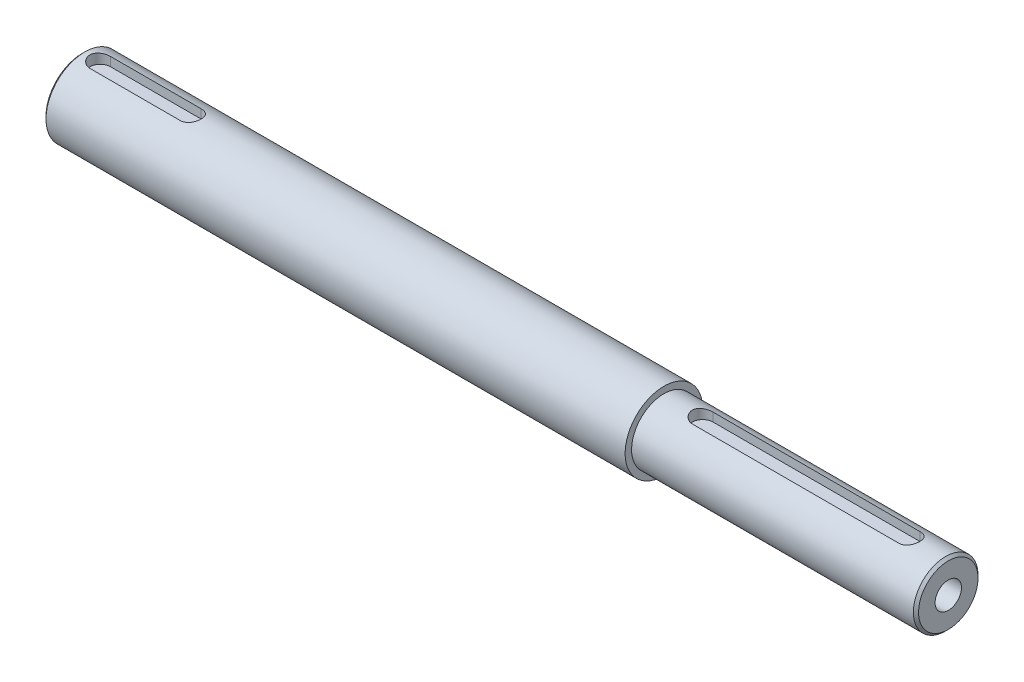
ISO-10303-21;
HEADER;
FILE_DESCRIPTION(('STEP AP214'),'2;1');
FILE_NAME('part.step','',(''),(''),'','','');
FILE_SCHEMA(('AUTOMOTIVE_DESIGN { 1 0 10303 214 1 1 1 1 }'));
ENDSEC;
DATA;
#1=APPLICATION_CONTEXT('core data for automotive mechanical design processes');
#2=APPLICATION_PROTOCOL_DEFINITION('international standard','automotive_design',2000,#1);
#3=PRODUCT_CONTEXT('',#1,'mechanical');
#4=PRODUCT('Part','Part','',(#3));
#5=PRODUCT_RELATED_PRODUCT_CATEGORY('part','',(#4));
#6=PRODUCT_DEFINITION_FORMATION('','',#4);
#7=PRODUCT_DEFINITION_CONTEXT('part definition',#1,'design');
#8=PRODUCT_DEFINITION('design','',#6,#7);
#9=PRODUCT_DEFINITION_SHAPE('','',#8);
#10=(LENGTH_UNIT() NAMED_UNIT(*) SI_UNIT(.MILLI.,.METRE.));
#11=(NAMED_UNIT(*) PLANE_ANGLE_UNIT() SI_UNIT($,.RADIAN.));
#12=(NAMED_UNIT(*) SI_UNIT($,.STERADIAN.) SOLID_ANGLE_UNIT());
#13=UNCERTAINTY_MEASURE_WITH_UNIT(LENGTH_MEASURE(1.E-05),#10,'distance_accuracy_value','');
#14=(GEOMETRIC_REPRESENTATION_CONTEXT(3) GLOBAL_UNCERTAINTY_ASSIGNED_CONTEXT((#13)) GLOBAL_UNIT_ASSIGNED_CONTEXT((#10,
#11,#12)) REPRESENTATION_CONTEXT('',''));
#15=CARTESIAN_POINT('',(0.,0.,0.));
#16=DIRECTION('',(0.,0.,1.));
#17=DIRECTION('',(1.,0.,0.));
#18=AXIS2_PLACEMENT_3D('',#15,#16,#17);
#19=CARTESIAN_POINT('',(74.7271192989297,0.,0.));
#20=DIRECTION('',(-1.,0.,0.));
#21=DIRECTION('',(0.,-1.,0.));
#22=AXIS2_PLACEMENT_3D('',#19,#20,#21);
#23=CYLINDRICAL_SURFACE('',#22,14.9999999999998);
#24=CARTESIAN_POINT('',(-166.5,2.64961082682653E-13,0.));
#25=DIRECTION('',(1.,0.,0.));
#26=DIRECTION('',(0.,1.,0.));
#27=AXIS2_PLACEMENT_3D('',#24,#25,#26);
#28=CIRCLE('',#27,14.9999999999998);
#29=CARTESIAN_POINT('',(-166.5,15.0000000000001,0.));
#30=VERTEX_POINT('',#29);
#31=EDGE_CURVE('E11',#30,#30,#28,.T.);
#32=ORIENTED_EDGE('',*,*,#31,.T.);
#33=EDGE_LOOP('',(#32));
#34=FACE_BOUND('',#33,.T.);
#35=CARTESIAN_POINT('',(57.5,0.,0.));
#36=DIRECTION('',(-1.,0.,0.));
#37=DIRECTION('',(0.,-1.,0.));
#38=AXIS2_PLACEMENT_3D('',#35,#36,#37);
#39=CIRCLE('',#38,15.);
#40=CARTESIAN_POINT('',(57.5,-14.9999999999999,0.));
#41=VERTEX_POINT('',#40);
#42=EDGE_CURVE('E157',#41,#41,#39,.T.);
#43=ORIENTED_EDGE('',*,*,#42,.T.);
#44=EDGE_LOOP('',(#43));
#45=FACE_BOUND('',#44,.T.);
#46=CARTESIAN_POINT('',(-125.5,14.456832294801,4.));
#47=CARTESIAN_POINT('',(-125.389641756596,14.4568189842468,4.00001309389174));
#48=CARTESIAN_POINT('',(-125.279291478007,14.4580956467717,3.99543311151603));
#49=CARTESIAN_POINT('',(-125.059421346034,14.4631301353517,3.97718874589725));
#50=CARTESIAN_POINT('',(-124.94990134224,14.466887500596,3.96352604983924));
#51=CARTESIAN_POINT('',(-124.732698346486,14.4767740441059,3.92725695741262));
#52=CARTESIAN_POINT('',(-124.625011912152,14.482898107258,3.90466984692445));
#53=CARTESIAN_POINT('',(-124.412025139644,14.4973231400468,3.85076543838184));
#54=CARTESIAN_POINT('',(-124.306724843415,14.5056241479175,3.81944798699437));
#55=CARTESIAN_POINT('',(-123.995536581225,14.5334412456827,3.71275643853686));
#56=CARTESIAN_POINT('',(-123.794125066453,14.5558829598252,3.62460332607935));
#57=CARTESIAN_POINT('',(-123.408979240374,14.6060171290377,3.41695780475819));
#58=CARTESIAN_POINT('',(-123.225250796028,14.6337113178035,3.29745504324306));
#59=CARTESIAN_POINT('',(-122.876029423072,14.6920016406367,3.0273032087801));
#60=CARTESIAN_POINT('',(-122.711038159034,14.7226489452443,2.87601544465619));
#61=CARTESIAN_POINT('',(-122.408442433038,14.7829523618629,2.54795832924029));
#62=CARTESIAN_POINT('',(-122.270842417132,14.8126083123118,2.37118484921248));
#63=CARTESIAN_POINT('',(-122.024827869815,14.8681604116922,1.99367199592155));
#64=CARTESIAN_POINT('',(-121.916916034422,14.8939887414058,1.79259414843396));
#65=CARTESIAN_POINT('',(-121.736627111039,14.9383834129136,1.3743557555279));
#66=CARTESIAN_POINT('',(-121.664242355223,14.9569513215518,1.15719869214847));
#67=CARTESIAN_POINT('',(-121.558690174831,14.9843709217853,0.718234307369671));
#68=CARTESIAN_POINT('',(-121.524662787106,14.9934353394138,0.496647293428105));
#69=CARTESIAN_POINT('',(-121.494085686777,15.0015705103633,0.050731991760575));
#70=CARTESIAN_POINT('',(-121.497530515807,15.0006427191927,-0.173595891963459));
#71=CARTESIAN_POINT('',(-121.541195686368,14.9890534931377,-0.612629502642175));
#72=CARTESIAN_POINT('',(-121.580486127656,14.9786381919443,-0.827435206418328));
#73=CARTESIAN_POINT('',(-121.693225150863,14.9495347795913,-1.24728467665105));
#74=CARTESIAN_POINT('',(-121.766675352151,14.9308462762364,-1.45232797980576));
#75=CARTESIAN_POINT('',(-121.946359966253,14.8869312076945,-1.84920963545356));
#76=CARTESIAN_POINT('',(-122.05291337223,14.8616414267933,-2.04089626466617));
#77=CARTESIAN_POINT('',(-122.295542768965,14.8072486052897,-2.40398441957148));
#78=CARTESIAN_POINT('',(-122.431623922183,14.7781448982354,-2.57538239000351));
#79=CARTESIAN_POINT('',(-122.734327971101,14.7182294237973,-2.89854935036781));
#80=CARTESIAN_POINT('',(-122.901758007894,14.6873926412644,-3.04955722400808));
#81=CARTESIAN_POINT('',(-123.260042840709,14.6282716207252,-3.32161448391783));
#82=CARTESIAN_POINT('',(-123.450904096481,14.599988090371,-3.4426555807802));
#83=CARTESIAN_POINT('',(-123.751353283365,14.5618587427771,-3.59932937334134));
#84=CARTESIAN_POINT('',(-123.854288915041,14.5498268172621,-3.64754371945348));
#85=CARTESIAN_POINT('',(-124.064046321272,14.5275984074126,-3.73509417643327));
#86=CARTESIAN_POINT('',(-124.170866512463,14.5174011851058,-3.77443385857864));
#87=CARTESIAN_POINT('',(-124.38751941922,14.4991713081512,-3.84386783810501));
#88=CARTESIAN_POINT('',(-124.497348878193,14.4911364080612,-3.87397173088604));
#89=CARTESIAN_POINT('',(-124.719275221125,14.4774747012192,-3.92471856960775));
#90=CARTESIAN_POINT('',(-124.83137102282,14.4718467722231,-3.9453659249532));
#91=CARTESIAN_POINT('',(-125.036251024718,14.463976133431,-3.97411378733403));
#92=CARTESIAN_POINT('',(-125.128796446167,14.4613012625134,-3.98382319960777));
#93=CARTESIAN_POINT('',(-125.31422535331,14.4577275048597,-3.99676420153356));
#94=CARTESIAN_POINT('',(-125.407108070432,14.456825809226,-4.00000603663184));
#95=CARTESIAN_POINT('',(-125.5,14.456832294801,-4.));
#96=B_SPLINE_CURVE_WITH_KNOTS('',3,(#46,#47,#48,#49,#50,#51,#52,#53,#54,#55,#56,#57,#58,#59,#60,
#61,#62,#63,#64,#65,#66,#67,#68,#69,#70,#71,#72,#73,#74,#75,#76,#77,#78,#79,#80,#81,#82,#83,#84,
#85,#86,#87,#88,#89,#90,#91,#92,#93,#94,#95),.UNSPECIFIED.,.F.,.F.,(4,2,2,2,2,2,2,2,2,2,2,2,2,2,
2,2,2,2,2,2,2,2,2,2,4),(0.,0.330958670878051,0.661855880768524,0.992041890688609,
1.32223370010826,1.98190700187183,2.64179842357631,3.3164963753615,3.99130375261119,
4.67691814590523,5.36238449759351,6.03215661862343,6.7018311790669,7.35461236515046,
8.00742449996359,8.66673340793704,9.32615767867957,10.0057598785669,10.6855498604333,
11.0281077435251,11.3705275300852,11.7125903499582,12.0544935096115,12.3335333037377,
12.6121307120356),.UNSPECIFIED.);
#97=CARTESIAN_POINT('',(-125.5,14.456832294801,4.));
#98=VERTEX_POINT('',#97);
#99=CARTESIAN_POINT('',(-125.5,14.456832294801,-4.));
#100=VERTEX_POINT('',#99);
#101=EDGE_CURVE('E202',#98,#100,#96,.T.);
#102=ORIENTED_EDGE('',*,*,#101,.F.);
#103=DIRECTION('',(-1.,0.,0.));
#104=VECTOR('',#103,1.);
#105=CARTESIAN_POINT('',(74.7271192989297,14.4568322948008,4.));
#106=LINE('',#105,#104);
#107=CARTESIAN_POINT('',(-160.5,14.456832294801,4.));
#108=VERTEX_POINT('',#107);
#109=EDGE_CURVE('E250',#108,#98,#106,.F.);
#110=ORIENTED_EDGE('',*,*,#109,.F.);
#111=CARTESIAN_POINT('',(-160.5,14.4568322948011,-4.));
#112=CARTESIAN_POINT('',(-160.610358243404,14.4568189842468,-4.00001309389174));
#113=CARTESIAN_POINT('',(-160.720708521993,14.4580956467718,-3.99543311151603));
#114=CARTESIAN_POINT('',(-160.940578653966,14.4631301353518,-3.97718874589725));
#115=CARTESIAN_POINT('',(-161.05009865776,14.466887500596,-3.96352604983924));
#116=CARTESIAN_POINT('',(-161.267301653514,14.4767740441059,-3.92725695741263));
#117=CARTESIAN_POINT('',(-161.374988087848,14.4828981072581,-3.90466984692446));
#118=CARTESIAN_POINT('',(-161.587974860356,14.4973231400468,-3.85076543838184));
#119=CARTESIAN_POINT('',(-161.693275156585,14.5056241479175,-3.81944798699437));
#120=CARTESIAN_POINT('',(-162.004463418775,14.5334412456828,-3.71275643853686));
#121=CARTESIAN_POINT('',(-162.205874933547,14.5558829598253,-3.62460332607936));
#122=CARTESIAN_POINT('',(-162.591020759626,14.6060171290378,-3.4169578047582));
#123=CARTESIAN_POINT('',(-162.774749203972,14.6337113178036,-3.29745504324306));
#124=CARTESIAN_POINT('',(-163.123970576928,14.6920016406367,-3.02730320878009));
#125=CARTESIAN_POINT('',(-163.288961840966,14.7226489452443,-2.87601544465618));
#126=CARTESIAN_POINT('',(-163.591557566962,14.7829523618629,-2.54795832924028));
#127=CARTESIAN_POINT('',(-163.729157582868,14.8126083123118,-2.37118484921248));
#128=CARTESIAN_POINT('',(-163.975172130186,14.8681604116922,-1.99367199592156));
#129=CARTESIAN_POINT('',(-164.083083965578,14.8939887414058,-1.79259414843396));
#130=CARTESIAN_POINT('',(-164.263372888961,14.9383834129137,-1.3743557555279));
#131=CARTESIAN_POINT('',(-164.335757644777,14.9569513215519,-1.15719869214845));
#132=CARTESIAN_POINT('',(-164.441309825169,14.9843709217853,-0.718234307369657));
#133=CARTESIAN_POINT('',(-164.475337212894,14.9934353394138,-0.496647293428093));
#134=CARTESIAN_POINT('',(-164.505914313223,15.0015705103633,-0.0507319917605658));
#135=CARTESIAN_POINT('',(-164.502469484193,15.0006427191927,0.173595891963466));
#136=CARTESIAN_POINT('',(-164.458804313632,14.9890534931377,0.612629502642181));
#137=CARTESIAN_POINT('',(-164.419513872344,14.9786381919444,0.827435206418335));
#138=CARTESIAN_POINT('',(-164.306774849137,14.9495347795914,1.24728467665106));
#139=CARTESIAN_POINT('',(-164.233324647849,14.9308462762365,1.45232797980576));
#140=CARTESIAN_POINT('',(-164.053640033747,14.8869312076946,1.84920963545356));
#141=CARTESIAN_POINT('',(-163.94708662777,14.8616414267934,2.04089626466618));
#142=CARTESIAN_POINT('',(-163.704457231035,14.8072486052898,2.40398441957149));
#143=CARTESIAN_POINT('',(-163.568376077817,14.7781448982354,2.57538239000351));
#144=CARTESIAN_POINT('',(-163.265672028899,14.7182294237974,2.89854935036781));
#145=CARTESIAN_POINT('',(-163.098241992106,14.6873926412644,3.04955722400809));
#146=CARTESIAN_POINT('',(-162.739957159291,14.6282716207253,3.32161448391783));
#147=CARTESIAN_POINT('',(-162.549095903519,14.599988090371,3.44265558078021));
#148=CARTESIAN_POINT('',(-162.248646716635,14.5618587427772,3.59932937334134));
#149=CARTESIAN_POINT('',(-162.145711084959,14.5498268172622,3.64754371945348));
#150=CARTESIAN_POINT('',(-161.935953678729,14.5275984074126,3.73509417643327));
#151=CARTESIAN_POINT('',(-161.829133487537,14.5174011851058,3.77443385857865));
#152=CARTESIAN_POINT('',(-161.61248058078,14.4991713081512,3.84386783810501));
#153=CARTESIAN_POINT('',(-161.502651121807,14.4911364080613,3.87397173088604));
#154=CARTESIAN_POINT('',(-161.280724778875,14.4774747012192,3.92471856960775));
#155=CARTESIAN_POINT('',(-161.16862897718,14.4718467722232,3.9453659249532));
#156=CARTESIAN_POINT('',(-160.963748975282,14.463976133431,3.97411378733403));
#157=CARTESIAN_POINT('',(-160.871203553833,14.4613012625134,3.98382319960777));
#158=CARTESIAN_POINT('',(-160.68577464669,14.4577275048597,3.99676420153356));
#159=CARTESIAN_POINT('',(-160.592891929568,14.456825809226,4.00000603663184));
#160=CARTESIAN_POINT('',(-160.5,14.4568322948011,4.));
#161=B_SPLINE_CURVE_WITH_KNOTS('',3,(#111,#112,#113,#114,#115,#116,#117,#118,#119,#120,#121,
#122,#123,#124,#125,#126,#127,#128,#129,#130,#131,#132,#133,#134,#135,#136,#137,#138,#139,#140,
#141,#142,#143,#144,#145,#146,#147,#148,#149,#150,#151,#152,#153,#154,#155,#156,#157,#158,#159,
#160),.UNSPECIFIED.,.F.,.F.,(4,2,2,2,2,2,2,2,2,2,2,2,2,2,2,2,2,2,2,2,2,2,2,2,4),(0.,
0.330958670878051,0.66185588076851,0.992041890688594,1.32223370010826,1.98190700187178,
2.64179842357632,3.31649637536151,3.99130375261119,4.67691814590525,5.36238449759353,
6.03215661862345,6.70183117906692,7.35461236515047,8.00742449996359,8.66673340793704,
9.32615767867959,10.005759878567,10.6855498604333,11.0281077435251,11.3705275300853,
11.7125903499582,12.0544935096115,12.3335333037377,12.6121307120356),.UNSPECIFIED.);
#162=CARTESIAN_POINT('',(-160.5,14.456832294801,-4.));
#163=VERTEX_POINT('',#162);
#164=EDGE_CURVE('E208',#163,#108,#161,.T.);
#165=ORIENTED_EDGE('',*,*,#164,.F.);
#166=DIRECTION('',(-1.,0.,0.));
#167=VECTOR('',#166,1.);
#168=CARTESIAN_POINT('',(74.7271192989297,14.4568322948008,-4.));
#169=LINE('',#168,#167);
#170=EDGE_CURVE('E251',#100,#163,#169,.T.);
#171=ORIENTED_EDGE('',*,*,#170,.F.);
#172=EDGE_LOOP('',(#102,#110,#165,#171));
#173=FACE_BOUND('',#172,.T.);
#174=ADVANCED_FACE('F38',(#34,#45,#173),#23,.T.);
#175=CARTESIAN_POINT('',(74.7271192989297,0.,0.));
#176=DIRECTION('',(-1.,0.,0.));
#177=DIRECTION('',(0.,-1.,0.));
#178=AXIS2_PLACEMENT_3D('',#175,#176,#177);
#179=CYLINDRICAL_SURFACE('',#178,12.5);
#180=CARTESIAN_POINT('',(166.5,0.,0.));
#181=DIRECTION('',(-1.,0.,0.));
#182=DIRECTION('',(0.,-1.,0.));
#183=AXIS2_PLACEMENT_3D('',#180,#181,#182);
#184=CIRCLE('',#183,12.5);
#185=CARTESIAN_POINT('',(166.5,-12.5000000000001,0.));
#186=VERTEX_POINT('',#185);
#187=EDGE_CURVE('E255',#186,#186,#184,.T.);
#188=ORIENTED_EDGE('',*,*,#187,.T.);
#189=EDGE_LOOP('',(#188));
#190=FACE_BOUND('',#189,.T.);
#191=CARTESIAN_POINT('',(57.5,0.,0.));
#192=DIRECTION('',(-1.,0.,0.));
#193=DIRECTION('',(0.,-1.,0.));
#194=AXIS2_PLACEMENT_3D('',#191,#192,#193);
#195=CIRCLE('',#194,12.5);
#196=CARTESIAN_POINT('',(57.5,-12.4999999999999,0.));
#197=VERTEX_POINT('',#196);
#198=EDGE_CURVE('E160',#197,#197,#195,.T.);
#199=ORIENTED_EDGE('',*,*,#198,.F.);
#200=EDGE_LOOP('',(#199));
#201=FACE_BOUND('',#200,.T.);
#202=CARTESIAN_POINT('',(72.5,11.8427192823271,-4.));
#203=CARTESIAN_POINT('',(72.3906002280384,11.8427027366059,-4.00001410484613));
#204=CARTESIAN_POINT('',(72.2812097901521,11.8442348052369,-3.995512175201));
#205=CARTESIAN_POINT('',(72.0632717592635,11.8502730910574,-3.97758606678449));
#206=CARTESIAN_POINT('',(71.9547239615155,11.8547785613244,-3.96416412872571));
#207=CARTESIAN_POINT('',(71.7395389691545,11.866624207631,-3.9285572511943));
#208=CARTESIAN_POINT('',(71.6328973043887,11.8739564736692,-3.9063967602145));
#209=CARTESIAN_POINT('',(71.4219943616284,11.8912164993789,-3.85353581488657));
#210=CARTESIAN_POINT('',(71.3177331598432,11.9011443420201,-3.82283508754056));
#211=CARTESIAN_POINT('',(71.0096949957216,11.9343840843196,-3.71831764495512));
#212=CARTESIAN_POINT('',(70.8103634479319,11.9611699822066,-3.63203544139887));
#213=CARTESIAN_POINT('',(70.4289874429581,12.0209583955878,-3.42895021192288));
#214=CARTESIAN_POINT('',(70.2469526209503,12.0539643457894,-3.31213030924909));
#215=CARTESIAN_POINT('',(69.8987460114008,12.1237984078071,-3.0467850788479));
#216=CARTESIAN_POINT('',(69.7332816756605,12.1607158548651,-2.89735303896515));
#217=CARTESIAN_POINT('',(69.4292851514111,12.2334561140966,-2.57296449846117));
#218=CARTESIAN_POINT('',(69.2907576516423,12.2692787347869,-2.39800356343233));
#219=CARTESIAN_POINT('',(69.0413848016294,12.3368244653945,-2.02237003010513));
#220=CARTESIAN_POINT('',(68.9312780435303,12.3684294972004,-1.82118394546977));
#221=CARTESIAN_POINT('',(68.7467505046506,12.4229251649938,-1.4019719735037));
#222=CARTESIAN_POINT('',(68.6723195262181,12.4458182908278,-1.18395091903582));
#223=CARTESIAN_POINT('',(68.5636411357495,12.4796767811417,-0.744713961063372));
#224=CARTESIAN_POINT('',(68.5281750666199,12.4910030499339,-0.523827920101163));
#225=CARTESIAN_POINT('',(68.4945672009583,12.5017287122873,-0.0789648151746447));
#226=CARTESIAN_POINT('',(68.4964172664751,12.5011307063103,0.145011564197636));
#227=CARTESIAN_POINT('',(68.5365988292713,12.4883236673358,0.581094974437686));
#228=CARTESIAN_POINT('',(68.5736077679788,12.4765355800409,0.793338226675231));
#229=CARTESIAN_POINT('',(68.6808805516063,12.4431945789581,1.2084232001272));
#230=CARTESIAN_POINT('',(68.7511462074328,12.4216411334262,1.41126440871777));
#231=CARTESIAN_POINT('',(68.9237578422357,12.3706364987475,1.80478548808183));
#232=CARTESIAN_POINT('',(69.0264965198688,12.3410893067348,1.99528012693526));
#233=CARTESIAN_POINT('',(69.2608290490452,12.2771965403044,2.35673113106228));
#234=CARTESIAN_POINT('',(69.392430206403,12.2428497517893,2.5276825327575));
#235=CARTESIAN_POINT('',(69.6874465312915,12.1712409097156,2.8530451152822));
#236=CARTESIAN_POINT('',(69.8519967025921,12.133917035257,3.00641313381737));
#237=CARTESIAN_POINT('',(70.2049719000853,12.0618172896257,3.28377291775701));
#238=CARTESIAN_POINT('',(70.3934042588321,12.0270422062066,3.40775562728565));
#239=CARTESIAN_POINT('',(70.6913712377486,11.9796198433082,3.56958208232606));
#240=CARTESIAN_POINT('',(70.7939990592415,11.9645161845073,3.61975674493765));
#241=CARTESIAN_POINT('',(71.0034047527517,11.9364591580623,3.71123075156255));
#242=CARTESIAN_POINT('',(71.1101808877864,11.9235049021447,3.75253376401034));
#243=CARTESIAN_POINT('',(71.3270133278916,11.900180234295,3.82585831579179));
#244=CARTESIAN_POINT('',(71.4370659779731,11.8898070557591,3.85788979915529));
#245=CARTESIAN_POINT('',(71.6596951569476,11.8719756673203,3.91241790563964));
#246=CARTESIAN_POINT('',(71.7722705037974,11.8645161211932,3.93491889994975));
#247=CARTESIAN_POINT('',(71.987239245861,11.8533815888388,3.96832908530803));
#248=CARTESIAN_POINT('',(72.0894674157946,11.8493925948396,3.9802038456482));
#249=CARTESIAN_POINT('',(72.2944610780333,11.8440568016293,3.99603937127681));
#250=CARTESIAN_POINT('',(72.3972256382805,11.8427063770563,4.00001099551563));
#251=CARTESIAN_POINT('',(72.5,11.8427192823271,4.));
#252=B_SPLINE_CURVE_WITH_KNOTS('',3,(#202,#203,#204,#205,#206,#207,#208,#209,#210,#211,#212,
#213,#214,#215,#216,#217,#218,#219,#220,#221,#222,#223,#224,#225,#226,#227,#228,#229,#230,#231,
#232,#233,#234,#235,#236,#237,#238,#239,#240,#241,#242,#243,#244,#245,#246,#247,#248,#249,#250,
#251),.UNSPECIFIED.,.F.,.F.,(4,2,2,2,2,2,2,2,2,2,2,2,2,2,2,2,2,2,2,2,2,2,2,2,4),(0.,
0.328080176984097,0.656077971124936,0.983164539368227,1.31026156448799,1.9635529398425,
2.61720612481382,3.29209427898755,3.96709980211696,4.65819584662372,5.34909422856992,
6.01770820975085,6.68617638029993,7.3304550155383,7.97476873730064,8.62719320105811,
9.27978300073407,9.96076419384898,10.6419549776068,10.9872862883783,11.3324745283028,
11.6772911585126,12.0219494657669,12.3305938648259,12.6388138912331),.UNSPECIFIED.);
#253=CARTESIAN_POINT('',(72.5,11.842719282327,-4.));
#254=VERTEX_POINT('',#253);
#255=CARTESIAN_POINT('',(72.5,11.842719282327,4.));
#256=VERTEX_POINT('',#255);
#257=EDGE_CURVE('E197',#254,#256,#252,.T.);
#258=ORIENTED_EDGE('',*,*,#257,.F.);
#259=DIRECTION('',(-1.,0.,0.));
#260=VECTOR('',#259,1.);
#261=CARTESIAN_POINT('',(74.7271192989297,11.8427192823271,-4.));
#262=LINE('',#261,#260);
#263=CARTESIAN_POINT('',(152.5,11.842719282327,-4.));
#264=VERTEX_POINT('',#263);
#265=EDGE_CURVE('E163',#264,#254,#262,.T.);
#266=ORIENTED_EDGE('',*,*,#265,.F.);
#267=CARTESIAN_POINT('',(152.5,11.842719282327,3.99999999999999));
#268=CARTESIAN_POINT('',(152.609399771962,11.8427027366058,4.00001410484612));
#269=CARTESIAN_POINT('',(152.718790209848,11.8442348052368,3.99551217520099));
#270=CARTESIAN_POINT('',(152.936728240736,11.8502730910574,3.97758606678448));
#271=CARTESIAN_POINT('',(153.045276038484,11.8547785613243,3.96416412872569));
#272=CARTESIAN_POINT('',(153.260461030845,11.8666242076309,3.92855725119428));
#273=CARTESIAN_POINT('',(153.367102695611,11.8739564736691,3.90639676021449));
#274=CARTESIAN_POINT('',(153.578005638372,11.8912164993788,3.85353581488656));
#275=CARTESIAN_POINT('',(153.682266840157,11.90114434202,3.82283508754055));
#276=CARTESIAN_POINT('',(153.990305004278,11.9343840843196,3.71831764495511));
#277=CARTESIAN_POINT('',(154.189636552068,11.9611699822065,3.63203544139887));
#278=CARTESIAN_POINT('',(154.571012557042,12.0209583955878,3.42895021192288));
#279=CARTESIAN_POINT('',(154.75304737905,12.0539643457893,3.3121303092491));
#280=CARTESIAN_POINT('',(155.101253988599,12.123798407807,3.0467850788479));
#281=CARTESIAN_POINT('',(155.266718324339,12.160715854865,2.89735303896514));
#282=CARTESIAN_POINT('',(155.570714848589,12.2334561140965,2.57296449846115));
#283=CARTESIAN_POINT('',(155.709242348358,12.2692787347869,2.39800356343231));
#284=CARTESIAN_POINT('',(155.958615198371,12.3368244653945,2.02237003010511));
#285=CARTESIAN_POINT('',(156.06872195647,12.3684294972003,1.82118394546975));
#286=CARTESIAN_POINT('',(156.253249495349,12.4229251649937,1.40197197350368));
#287=CARTESIAN_POINT('',(156.327680473782,12.4458182908277,1.1839509190358));
#288=CARTESIAN_POINT('',(156.436358864251,12.4796767811416,0.744713961063362));
#289=CARTESIAN_POINT('',(156.47182493338,12.4910030499338,0.523827920101151));
#290=CARTESIAN_POINT('',(156.505432799042,12.5017287122873,0.0789648151746314));
#291=CARTESIAN_POINT('',(156.503582733525,12.5011307063103,-0.14501156419765));
#292=CARTESIAN_POINT('',(156.463401170729,12.4883236673358,-0.581094974437703));
#293=CARTESIAN_POINT('',(156.426392232021,12.4765355800408,-0.793338226675252));
#294=CARTESIAN_POINT('',(156.319119448394,12.443194578958,-1.20842320012722));
#295=CARTESIAN_POINT('',(156.248853792567,12.4216411334261,-1.41126440871779));
#296=CARTESIAN_POINT('',(156.076242157764,12.3706364987475,-1.80478548808184));
#297=CARTESIAN_POINT('',(155.973503480131,12.3410893067347,-1.99528012693528));
#298=CARTESIAN_POINT('',(155.739170950955,12.2771965403044,-2.3567311310623));
#299=CARTESIAN_POINT('',(155.607569793597,12.2428497517892,-2.52768253275752));
#300=CARTESIAN_POINT('',(155.312553468708,12.1712409097156,-2.85304511528221));
#301=CARTESIAN_POINT('',(155.148003297408,12.1339170352569,-3.00641313381737));
#302=CARTESIAN_POINT('',(154.795028099915,12.0618172896256,-3.28377291775702));
#303=CARTESIAN_POINT('',(154.606595741168,12.0270422062065,-3.40775562728566));
#304=CARTESIAN_POINT('',(154.308628762251,11.9796198433081,-3.56958208232608));
#305=CARTESIAN_POINT('',(154.206000940758,11.9645161845072,-3.61975674493766));
#306=CARTESIAN_POINT('',(153.996595247248,11.9364591580623,-3.71123075156256));
#307=CARTESIAN_POINT('',(153.889819112214,11.9235049021446,-3.75253376401035));
#308=CARTESIAN_POINT('',(153.672986672108,11.9001802342949,-3.8258583157918));
#309=CARTESIAN_POINT('',(153.562934022027,11.889807055759,-3.85788979915531));
#310=CARTESIAN_POINT('',(153.340304843052,11.8719756673203,-3.91241790563966));
#311=CARTESIAN_POINT('',(153.227729496203,11.8645161211931,-3.93491889994977));
#312=CARTESIAN_POINT('',(153.012760754139,11.8533815888387,-3.96832908530805));
#313=CARTESIAN_POINT('',(152.910532584205,11.8493925948395,-3.98020384564822));
#314=CARTESIAN_POINT('',(152.705538921967,11.8440568016292,-3.99603937127682));
#315=CARTESIAN_POINT('',(152.602774361719,11.8427063770563,-4.00001099551565));
#316=CARTESIAN_POINT('',(152.5,11.842719282327,-4.00000000000002));
#317=B_SPLINE_CURVE_WITH_KNOTS('',3,(#267,#268,#269,#270,#271,#272,#273,#274,#275,#276,#277,
#278,#279,#280,#281,#282,#283,#284,#285,#286,#287,#288,#289,#290,#291,#292,#293,#294,#295,#296,
#297,#298,#299,#300,#301,#302,#303,#304,#305,#306,#307,#308,#309,#310,#311,#312,#313,#314,#315,
#316),.UNSPECIFIED.,.F.,.F.,(4,2,2,2,2,2,2,2,2,2,2,2,2,2,2,2,2,2,2,2,2,2,2,2,4),(0.,
0.328080176984111,0.656077971124936,0.983164539368185,1.31026156448799,1.96355293984244,
2.61720612481379,3.29209427898754,3.96709980211696,4.65819584662372,5.34909422856991,
6.01770820975084,6.68617638029993,7.33045501553829,7.97476873730064,8.62719320105809,
9.27978300073407,9.96076419384895,10.6419549776068,10.9872862883783,11.3324745283028,
11.6772911585126,12.0219494657669,12.3305938648259,12.6388138912331),.UNSPECIFIED.);
#318=CARTESIAN_POINT('',(152.5,11.842719282327,3.99999999999999));
#319=VERTEX_POINT('',#318);
#320=EDGE_CURVE('E165',#319,#264,#317,.T.);
#321=ORIENTED_EDGE('',*,*,#320,.F.);
#322=DIRECTION('',(-1.,0.,0.));
#323=VECTOR('',#322,1.);
#324=CARTESIAN_POINT('',(74.7271192989297,11.8427192823271,4.));
#325=LINE('',#324,#323);
#326=EDGE_CURVE('E172',#256,#319,#325,.F.);
#327=ORIENTED_EDGE('',*,*,#326,.F.);
#328=EDGE_LOOP('',(#258,#266,#321,#327));
#329=FACE_BOUND('',#328,.T.);
#330=ADVANCED_FACE('F174',(#190,#201,#329),#179,.T.);
#331=CARTESIAN_POINT('',(167.5,12.5,0.));
#332=DIRECTION('',(-1.,0.,0.));
#333=DIRECTION('',(0.,-1.,0.));
#334=AXIS2_PLACEMENT_3D('',#331,#332,#333);
#335=PLANE('',#334);
#336=CARTESIAN_POINT('',(167.5,-1.64916724579521E-13,0.));
#337=DIRECTION('',(1.,0.,0.));
#338=DIRECTION('',(0.,0.,-1.));
#339=AXIS2_PLACEMENT_3D('',#336,#337,#338);
#340=CIRCLE('',#339,5.09999999999999);
#341=CARTESIAN_POINT('',(167.5,-1.64916724579521E-13,-5.09999999999999));
#342=VERTEX_POINT('',#341);
#343=EDGE_CURVE('E115',#342,#342,#340,.T.);
#344=ORIENTED_EDGE('',*,*,#343,.F.);
#345=EDGE_LOOP('',(#344));
#346=FACE_BOUND('',#345,.T.);
#347=CARTESIAN_POINT('',(167.5,0.,0.));
#348=DIRECTION('',(-1.,0.,0.));
#349=DIRECTION('',(0.,-1.,0.));
#350=AXIS2_PLACEMENT_3D('',#347,#348,#349);
#351=CIRCLE('',#350,11.5);
#352=CARTESIAN_POINT('',(167.5,-11.5000000000001,0.));
#353=VERTEX_POINT('',#352);
#354=EDGE_CURVE('E265',#353,#353,#351,.F.);
#355=ORIENTED_EDGE('',*,*,#354,.T.);
#356=EDGE_LOOP('',(#355));
#357=FACE_BOUND('',#356,.T.);
#358=ADVANCED_FACE('F241',(#346,#357),#335,.F.);
#359=CARTESIAN_POINT('',(57.5,15.,0.));
#360=DIRECTION('',(-1.,0.,0.));
#361=DIRECTION('',(0.,-1.,0.));
#362=AXIS2_PLACEMENT_3D('',#359,#360,#361);
#363=PLANE('',#362);
#364=ORIENTED_EDGE('',*,*,#42,.F.);
#365=EDGE_LOOP('',(#364));
#366=FACE_BOUND('',#365,.T.);
#367=ORIENTED_EDGE('',*,*,#198,.T.);
#368=EDGE_LOOP('',(#367));
#369=FACE_BOUND('',#368,.T.);
#370=ADVANCED_FACE('F284',(#366,#369),#363,.F.);
#371=CARTESIAN_POINT('',(-167.5,0.,0.));
#372=DIRECTION('',(1.,0.,0.));
#373=DIRECTION('',(0.,1.,0.));
#374=AXIS2_PLACEMENT_3D('',#371,#372,#373);
#375=PLANE('',#374);
#376=CARTESIAN_POINT('',(-167.5,2.65945660142829E-13,0.));
#377=DIRECTION('',(1.,0.,0.));
#378=DIRECTION('',(0.,1.,0.));
#379=AXIS2_PLACEMENT_3D('',#376,#377,#378);
#380=CIRCLE('',#379,13.9999999999998);
#381=CARTESIAN_POINT('',(-167.5,14.,0.));
#382=VERTEX_POINT('',#381);
#383=EDGE_CURVE('E46',#382,#382,#380,.F.);
#384=ORIENTED_EDGE('',*,*,#383,.T.);
#385=EDGE_LOOP('',(#384));
#386=FACE_BOUND('',#385,.T.);
#387=ADVANCED_FACE('F194',(#386),#375,.F.);
#388=CARTESIAN_POINT('',(72.5,15.,0.));
#389=DIRECTION('',(0.,-1.,0.));
#390=DIRECTION('',(0.,0.,-1.));
#391=AXIS2_PLACEMENT_3D('',#388,#389,#390);
#392=CYLINDRICAL_SURFACE('',#391,4.);
#393=ORIENTED_EDGE('',*,*,#257,.T.);
#394=DIRECTION('',(0.,-1.,0.));
#395=VECTOR('',#394,1.);
#396=CARTESIAN_POINT('',(72.5,15.,4.));
#397=LINE('',#396,#395);
#398=CARTESIAN_POINT('',(72.5,8.5,4.));
#399=VERTEX_POINT('',#398);
#400=EDGE_CURVE('E155',#256,#399,#397,.T.);
#401=ORIENTED_EDGE('',*,*,#400,.T.);
#402=CARTESIAN_POINT('',(72.5,8.5,0.));
#403=DIRECTION('',(0.,1.,0.));
#404=DIRECTION('',(0.,0.,1.));
#405=AXIS2_PLACEMENT_3D('',#402,#403,#404);
#406=CIRCLE('',#405,4.);
#407=CARTESIAN_POINT('',(72.5,8.5,-4.));
#408=VERTEX_POINT('',#407);
#409=EDGE_CURVE('E138',#408,#399,#406,.T.);
#410=ORIENTED_EDGE('',*,*,#409,.F.);
#411=DIRECTION('',(0.,-1.,0.));
#412=VECTOR('',#411,1.);
#413=CARTESIAN_POINT('',(72.5,15.,-4.));
#414=LINE('',#413,#412);
#415=EDGE_CURVE('E150',#254,#408,#414,.T.);
#416=ORIENTED_EDGE('',*,*,#415,.F.);
#417=EDGE_LOOP('',(#393,#401,#410,#416));
#418=FACE_BOUND('',#417,.T.);
#419=ADVANCED_FACE('F189',(#418),#392,.F.);
#420=CARTESIAN_POINT('',(72.5,15.,4.));
#421=DIRECTION('',(0.,0.,-1.));
#422=DIRECTION('',(-1.,0.,0.));
#423=AXIS2_PLACEMENT_3D('',#420,#421,#422);
#424=PLANE('',#423);
#425=ORIENTED_EDGE('',*,*,#326,.T.);
#426=DIRECTION('',(0.,-1.,0.));
#427=VECTOR('',#426,1.);
#428=CARTESIAN_POINT('',(152.5,15.,3.99999999999999));
#429=LINE('',#428,#427);
#430=CARTESIAN_POINT('',(152.5,8.5,3.99999999999999));
#431=VERTEX_POINT('',#430);
#432=EDGE_CURVE('E153',#319,#431,#429,.T.);
#433=ORIENTED_EDGE('',*,*,#432,.T.);
#434=DIRECTION('',(1.,0.,0.));
#435=VECTOR('',#434,1.);
#436=CARTESIAN_POINT('',(72.5,8.5,4.));
#437=LINE('',#436,#435);
#438=EDGE_CURVE('E141',#399,#431,#437,.T.);
#439=ORIENTED_EDGE('',*,*,#438,.F.);
#440=ORIENTED_EDGE('',*,*,#400,.F.);
#441=EDGE_LOOP('',(#425,#433,#439,#440));
#442=FACE_BOUND('',#441,.T.);
#443=ADVANCED_FACE('F184',(#442),#424,.T.);
#444=CARTESIAN_POINT('',(152.5,15.,0.));
#445=DIRECTION('',(0.,-1.,0.));
#446=DIRECTION('',(0.,0.,-1.));
#447=AXIS2_PLACEMENT_3D('',#444,#445,#446);
#448=CYLINDRICAL_SURFACE('',#447,4.);
#449=ORIENTED_EDGE('',*,*,#320,.T.);
#450=DIRECTION('',(0.,-1.,0.));
#451=VECTOR('',#450,1.);
#452=CARTESIAN_POINT('',(152.5,15.,-4.00000000000002));
#453=LINE('',#452,#451);
#454=CARTESIAN_POINT('',(152.5,8.5,-4.00000000000002));
#455=VERTEX_POINT('',#454);
#456=EDGE_CURVE('E61',#264,#455,#453,.T.);
#457=ORIENTED_EDGE('',*,*,#456,.T.);
#458=CARTESIAN_POINT('',(152.5,8.5,0.));
#459=DIRECTION('',(0.,1.,0.));
#460=DIRECTION('',(0.,0.,1.));
#461=AXIS2_PLACEMENT_3D('',#458,#459,#460);
#462=CIRCLE('',#461,4.);
#463=EDGE_CURVE('E144',#431,#455,#462,.T.);
#464=ORIENTED_EDGE('',*,*,#463,.F.);
#465=ORIENTED_EDGE('',*,*,#432,.F.);
#466=EDGE_LOOP('',(#449,#457,#464,#465));
#467=FACE_BOUND('',#466,.T.);
#468=ADVANCED_FACE('F178',(#467),#448,.F.);
#469=CARTESIAN_POINT('',(72.5,15.,-4.));
#470=DIRECTION('',(0.,0.,1.));
#471=DIRECTION('',(1.,0.,0.));
#472=AXIS2_PLACEMENT_3D('',#469,#470,#471);
#473=PLANE('',#472);
#474=ORIENTED_EDGE('',*,*,#265,.T.);
#475=ORIENTED_EDGE('',*,*,#415,.T.);
#476=DIRECTION('',(-1.,0.,0.));
#477=VECTOR('',#476,1.);
#478=CARTESIAN_POINT('',(72.5,8.5,-4.));
#479=LINE('',#478,#477);
#480=EDGE_CURVE('E147',#455,#408,#479,.T.);
#481=ORIENTED_EDGE('',*,*,#480,.F.);
#482=ORIENTED_EDGE('',*,*,#456,.F.);
#483=EDGE_LOOP('',(#474,#475,#481,#482));
#484=FACE_BOUND('',#483,.T.);
#485=ADVANCED_FACE('F183',(#484),#473,.T.);
#486=CARTESIAN_POINT('',(72.5,8.5,0.));
#487=DIRECTION('',(0.,1.,0.));
#488=DIRECTION('',(0.,0.,1.));
#489=AXIS2_PLACEMENT_3D('',#486,#487,#488);
#490=PLANE('',#489);
#491=ORIENTED_EDGE('',*,*,#409,.T.);
#492=ORIENTED_EDGE('',*,*,#438,.T.);
#493=ORIENTED_EDGE('',*,*,#463,.T.);
#494=ORIENTED_EDGE('',*,*,#480,.T.);
#495=EDGE_LOOP('',(#491,#492,#493,#494));
#496=FACE_BOUND('',#495,.T.);
#497=ADVANCED_FACE('F229',(#496),#490,.T.);
#498=CARTESIAN_POINT('',(-160.5,15.,0.));
#499=DIRECTION('',(0.,-1.,0.));
#500=DIRECTION('',(0.,0.,-1.));
#501=AXIS2_PLACEMENT_3D('',#498,#499,#500);
#502=CYLINDRICAL_SURFACE('',#501,4.);
#503=DIRECTION('',(0.,-1.,0.));
#504=VECTOR('',#503,1.);
#505=CARTESIAN_POINT('',(-160.5,15.,-4.));
#506=LINE('',#505,#504);
#507=CARTESIAN_POINT('',(-160.5,11.,-4.));
#508=VERTEX_POINT('',#507);
#509=EDGE_CURVE('E131',#163,#508,#506,.T.);
#510=ORIENTED_EDGE('',*,*,#509,.F.);
#511=ORIENTED_EDGE('',*,*,#164,.T.);
#512=DIRECTION('',(0.,-1.,0.));
#513=VECTOR('',#512,1.);
#514=CARTESIAN_POINT('',(-160.5,15.,4.));
#515=LINE('',#514,#513);
#516=CARTESIAN_POINT('',(-160.5,11.,4.));
#517=VERTEX_POINT('',#516);
#518=EDGE_CURVE('E136',#108,#517,#515,.T.);
#519=ORIENTED_EDGE('',*,*,#518,.T.);
#520=CARTESIAN_POINT('',(-160.5,11.,0.));
#521=DIRECTION('',(0.,1.,0.));
#522=DIRECTION('',(0.,0.,1.));
#523=AXIS2_PLACEMENT_3D('',#520,#521,#522);
#524=CIRCLE('',#523,4.);
#525=EDGE_CURVE('E114',#508,#517,#524,.T.);
#526=ORIENTED_EDGE('',*,*,#525,.F.);
#527=EDGE_LOOP('',(#510,#511,#519,#526));
#528=FACE_BOUND('',#527,.T.);
#529=ADVANCED_FACE('F225',(#528),#502,.F.);
#530=CARTESIAN_POINT('',(-160.5,15.,4.));
#531=DIRECTION('',(0.,0.,-1.));
#532=DIRECTION('',(-1.,0.,0.));
#533=AXIS2_PLACEMENT_3D('',#530,#531,#532);
#534=PLANE('',#533);
#535=ORIENTED_EDGE('',*,*,#109,.T.);
#536=DIRECTION('',(0.,-1.,0.));
#537=VECTOR('',#536,1.);
#538=CARTESIAN_POINT('',(-125.5,15.,4.));
#539=LINE('',#538,#537);
#540=CARTESIAN_POINT('',(-125.5,11.,4.));
#541=VERTEX_POINT('',#540);
#542=EDGE_CURVE('E134',#98,#541,#539,.T.);
#543=ORIENTED_EDGE('',*,*,#542,.T.);
#544=DIRECTION('',(1.,0.,0.));
#545=VECTOR('',#544,1.);
#546=CARTESIAN_POINT('',(-160.5,11.,4.));
#547=LINE('',#546,#545);
#548=EDGE_CURVE('E118',#517,#541,#547,.T.);
#549=ORIENTED_EDGE('',*,*,#548,.F.);
#550=ORIENTED_EDGE('',*,*,#518,.F.);
#551=EDGE_LOOP('',(#535,#543,#549,#550));
#552=FACE_BOUND('',#551,.T.);
#553=ADVANCED_FACE('F221',(#552),#534,.T.);
#554=CARTESIAN_POINT('',(-125.5,15.,0.));
#555=DIRECTION('',(0.,-1.,0.));
#556=DIRECTION('',(0.,0.,-1.));
#557=AXIS2_PLACEMENT_3D('',#554,#555,#556);
#558=CYLINDRICAL_SURFACE('',#557,4.);
#559=ORIENTED_EDGE('',*,*,#542,.F.);
#560=ORIENTED_EDGE('',*,*,#101,.T.);
#561=DIRECTION('',(0.,-1.,0.));
#562=VECTOR('',#561,1.);
#563=CARTESIAN_POINT('',(-125.5,15.,-4.));
#564=LINE('',#563,#562);
#565=CARTESIAN_POINT('',(-125.5,11.,-4.));
#566=VERTEX_POINT('',#565);
#567=EDGE_CURVE('E53',#100,#566,#564,.T.);
#568=ORIENTED_EDGE('',*,*,#567,.T.);
#569=CARTESIAN_POINT('',(-125.5,11.,0.));
#570=DIRECTION('',(0.,1.,0.));
#571=DIRECTION('',(0.,0.,1.));
#572=AXIS2_PLACEMENT_3D('',#569,#570,#571);
#573=CIRCLE('',#572,4.);
#574=EDGE_CURVE('E125',#541,#566,#573,.T.);
#575=ORIENTED_EDGE('',*,*,#574,.F.);
#576=EDGE_LOOP('',(#559,#560,#568,#575));
#577=FACE_BOUND('',#576,.T.);
#578=ADVANCED_FACE('F215',(#577),#558,.F.);
#579=CARTESIAN_POINT('',(-160.5,15.,-4.));
#580=DIRECTION('',(0.,0.,1.));
#581=DIRECTION('',(1.,0.,0.));
#582=AXIS2_PLACEMENT_3D('',#579,#580,#581);
#583=PLANE('',#582);
#584=ORIENTED_EDGE('',*,*,#170,.T.);
#585=ORIENTED_EDGE('',*,*,#509,.T.);
#586=DIRECTION('',(-1.,0.,0.));
#587=VECTOR('',#586,1.);
#588=CARTESIAN_POINT('',(-160.5,11.,-4.));
#589=LINE('',#588,#587);
#590=EDGE_CURVE('E128',#566,#508,#589,.T.);
#591=ORIENTED_EDGE('',*,*,#590,.F.);
#592=ORIENTED_EDGE('',*,*,#567,.F.);
#593=EDGE_LOOP('',(#584,#585,#591,#592));
#594=FACE_BOUND('',#593,.T.);
#595=ADVANCED_FACE('F220',(#594),#583,.T.);
#596=CARTESIAN_POINT('',(-160.5,11.,0.));
#597=DIRECTION('',(0.,1.,0.));
#598=DIRECTION('',(0.,0.,1.));
#599=AXIS2_PLACEMENT_3D('',#596,#597,#598);
#600=PLANE('',#599);
#601=ORIENTED_EDGE('',*,*,#525,.T.);
#602=ORIENTED_EDGE('',*,*,#548,.T.);
#603=ORIENTED_EDGE('',*,*,#574,.T.);
#604=ORIENTED_EDGE('',*,*,#590,.T.);
#605=EDGE_LOOP('',(#601,#602,#603,#604));
#606=FACE_BOUND('',#605,.T.);
#607=ADVANCED_FACE('F259',(#606),#600,.T.);
#608=CARTESIAN_POINT('',(166.5,0.,0.));
#609=DIRECTION('',(-1.,0.,0.));
#610=DIRECTION('',(0.,-1.,0.));
#611=AXIS2_PLACEMENT_3D('',#608,#609,#610);
#612=CONICAL_SURFACE('',#611,12.5,0.785398163397451);
#613=ORIENTED_EDGE('',*,*,#354,.F.);
#614=EDGE_LOOP('',(#613));
#615=FACE_BOUND('',#614,.T.);
#616=ORIENTED_EDGE('',*,*,#187,.F.);
#617=EDGE_LOOP('',(#616));
#618=FACE_BOUND('',#617,.T.);
#619=ADVANCED_FACE('F272',(#615,#618),#612,.T.);
#620=CARTESIAN_POINT('',(-167.5,2.65945660142829E-13,0.));
#621=DIRECTION('',(1.,0.,0.));
#622=DIRECTION('',(0.,1.,0.));
#623=AXIS2_PLACEMENT_3D('',#620,#621,#622);
#624=CONICAL_SURFACE('',#623,13.9999999999998,0.78539816339744);
#625=ORIENTED_EDGE('',*,*,#31,.F.);
#626=EDGE_LOOP('',(#625));
#627=FACE_BOUND('',#626,.T.);
#628=ORIENTED_EDGE('',*,*,#383,.F.);
#629=EDGE_LOOP('',(#628));
#630=FACE_BOUND('',#629,.T.);
#631=ADVANCED_FACE('F40',(#627,#630),#624,.T.);
#632=CARTESIAN_POINT('',(134.75,-1.64916724579521E-13,0.));
#633=DIRECTION('',(1.,0.,0.));
#634=DIRECTION('',(0.,0.,-1.));
#635=AXIS2_PLACEMENT_3D('',#632,#633,#634);
#636=CONICAL_SURFACE('',#635,5.09999999999998,1.02974425867665);
#637=CARTESIAN_POINT('',(131.685610842959,-1.73688719988438E-13,0.));
#638=VERTEX_POINT('',#637);
#639=VERTEX_LOOP('',#638);
#640=FACE_BOUND('',#639,.T.);
#641=CARTESIAN_POINT('',(134.75,-1.64916724579521E-13,0.));
#642=DIRECTION('',(1.,0.,0.));
#643=DIRECTION('',(0.,0.,-1.));
#644=AXIS2_PLACEMENT_3D('',#641,#642,#643);
#645=CIRCLE('',#644,5.09999999999998);
#646=CARTESIAN_POINT('',(134.75,-1.64916724579521E-13,-5.09999999999998));
#647=VERTEX_POINT('',#646);
#648=EDGE_CURVE('E112',#647,#647,#645,.T.);
#649=ORIENTED_EDGE('',*,*,#648,.T.);
#650=EDGE_LOOP('',(#649));
#651=FACE_BOUND('',#650,.T.);
#652=ADVANCED_FACE('F105',(#640,#651),#636,.F.);
#653=CARTESIAN_POINT('',(167.5,-1.64916724579521E-13,0.));
#654=DIRECTION('',(1.,0.,0.));
#655=DIRECTION('',(0.,0.,-1.));
#656=AXIS2_PLACEMENT_3D('',#653,#654,#655);
#657=CYLINDRICAL_SURFACE('',#656,5.09999999999999);
#658=ORIENTED_EDGE('',*,*,#648,.F.);
#659=EDGE_LOOP('',(#658));
#660=FACE_BOUND('',#659,.T.);
#661=ORIENTED_EDGE('',*,*,#343,.T.);
#662=EDGE_LOOP('',(#661));
#663=FACE_BOUND('',#662,.T.);
#664=ADVANCED_FACE('F108',(#660,#663),#657,.F.);
#665=CLOSED_SHELL('',(#174,#330,#358,#370,#387,#419,#443,#468,#485,#497,#529,#553,#578,#595,
#607,#619,#631,#652,#664));
#666=MANIFOLD_SOLID_BREP('B2',#665);
#667=ADVANCED_BREP_SHAPE_REPRESENTATION('',(#18,#666),#14);
#668=SHAPE_DEFINITION_REPRESENTATION(#9,#667);
ENDSEC;
END-ISO-10303-21;
